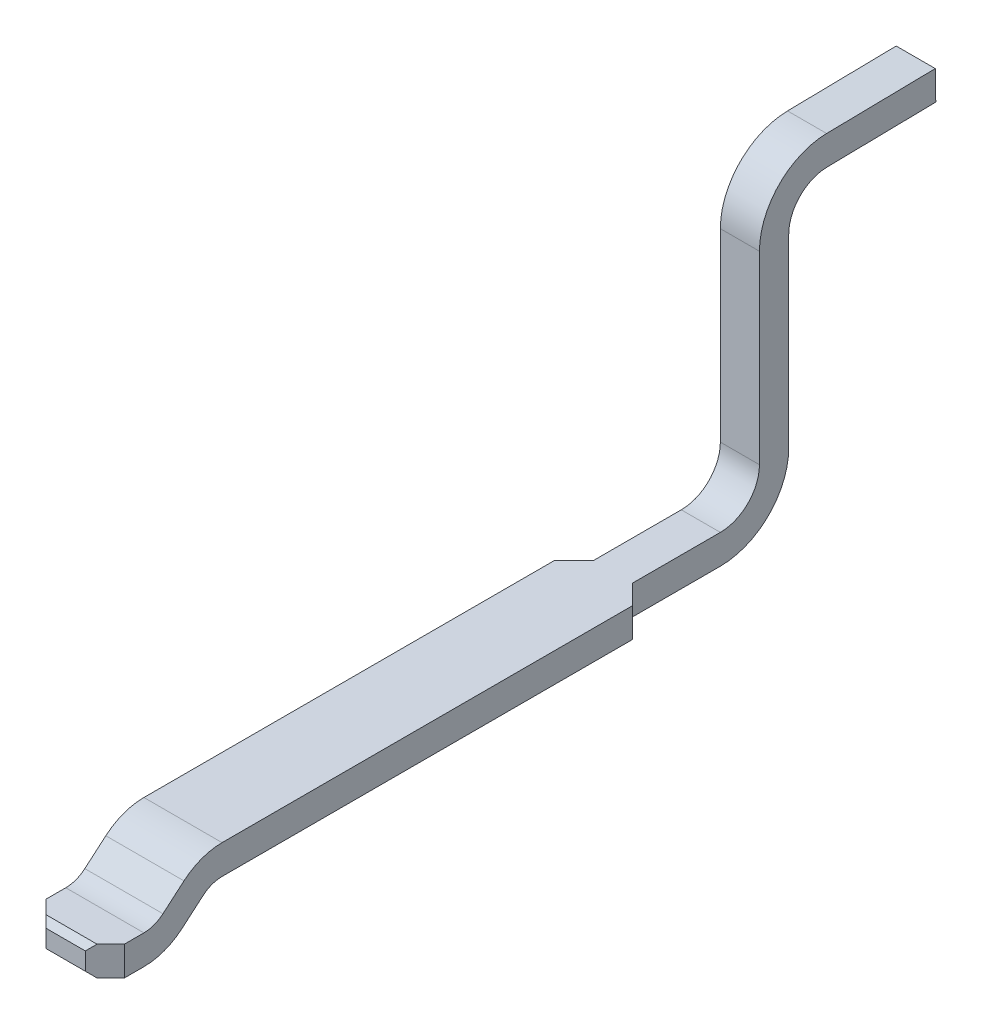
ISO-10303-21;
HEADER;
FILE_DESCRIPTION(('STEP AP214'),'2;1');
FILE_NAME('part.step','',(''),(''),'','','');
FILE_SCHEMA(('AUTOMOTIVE_DESIGN { 1 0 10303 214 1 1 1 1 }'));
ENDSEC;
DATA;
#1=APPLICATION_CONTEXT('core data for automotive mechanical design processes');
#2=APPLICATION_PROTOCOL_DEFINITION('international standard','automotive_design',2000,#1);
#3=PRODUCT_CONTEXT('',#1,'mechanical');
#4=PRODUCT('Part','Part','',(#3));
#5=PRODUCT_RELATED_PRODUCT_CATEGORY('part','',(#4));
#6=PRODUCT_DEFINITION_FORMATION('','',#4);
#7=PRODUCT_DEFINITION_CONTEXT('part definition',#1,'design');
#8=PRODUCT_DEFINITION('design','',#6,#7);
#9=PRODUCT_DEFINITION_SHAPE('','',#8);
#10=(LENGTH_UNIT() NAMED_UNIT(*) SI_UNIT(.MILLI.,.METRE.));
#11=(NAMED_UNIT(*) PLANE_ANGLE_UNIT() SI_UNIT($,.RADIAN.));
#12=(NAMED_UNIT(*) SI_UNIT($,.STERADIAN.) SOLID_ANGLE_UNIT());
#13=UNCERTAINTY_MEASURE_WITH_UNIT(LENGTH_MEASURE(1.E-05),#10,'distance_accuracy_value','');
#14=(GEOMETRIC_REPRESENTATION_CONTEXT(3) GLOBAL_UNCERTAINTY_ASSIGNED_CONTEXT((#13)) GLOBAL_UNIT_ASSIGNED_CONTEXT((#10,
#11,#12)) REPRESENTATION_CONTEXT('',''));
#15=CARTESIAN_POINT('',(0.,0.,0.));
#16=DIRECTION('',(0.,0.,1.));
#17=DIRECTION('',(1.,0.,0.));
#18=AXIS2_PLACEMENT_3D('',#15,#16,#17);
#19=CARTESIAN_POINT('',(3.80403496496787,8.074228109921,4.324047830079));
#20=DIRECTION('',(0.,0.707106781186548,0.707106781186548));
#21=DIRECTION('',(0.,-0.707106781186548,0.707106781186548));
#22=AXIS2_PLACEMENT_3D('',#19,#20,#21);
#23=PLANE('',#22);
#24=DIRECTION('',(-0.577350269189637,0.577350269189612,-0.577350269189629));
#25=VECTOR('',#24,1.);
#26=CARTESIAN_POINT('',(3.83973309999987,8.04019892,4.35807702));
#27=LINE('',#26,#25);
#28=CARTESIAN_POINT('',(3.83973309999987,8.04019892,4.35807702));
#29=VERTEX_POINT('',#28);
#30=CARTESIAN_POINT('',(3.80973309999987,8.07019892,4.32807702));
#31=VERTEX_POINT('',#30);
#32=EDGE_CURVE('E279',#29,#31,#27,.T.);
#33=ORIENTED_EDGE('',*,*,#32,.F.);
#34=DIRECTION('',(-1.,0.,0.));
#35=VECTOR('',#34,1.);
#36=CARTESIAN_POINT('',(4.04543123503187,8.04019892,4.35807702));
#37=LINE('',#36,#35);
#38=CARTESIAN_POINT('',(4.03973309999987,8.04019892,4.35807702));
#39=VERTEX_POINT('',#38);
#40=EDGE_CURVE('E356',#29,#39,#37,.F.);
#41=ORIENTED_EDGE('',*,*,#40,.T.);
#42=DIRECTION('',(-0.577350269189631,-0.577350269189615,0.577350269189631));
#43=VECTOR('',#42,1.);
#44=CARTESIAN_POINT('',(4.06973309999987,8.07019892,4.32807702));
#45=LINE('',#44,#43);
#46=CARTESIAN_POINT('',(4.06973309999987,8.07019892,4.32807702));
#47=VERTEX_POINT('',#46);
#48=EDGE_CURVE('E269',#47,#39,#45,.T.);
#49=ORIENTED_EDGE('',*,*,#48,.F.);
#50=DIRECTION('',(1.,0.,0.));
#51=VECTOR('',#50,1.);
#52=CARTESIAN_POINT('',(4.14773309999987,8.07019892,4.32807702));
#53=LINE('',#52,#51);
#54=EDGE_CURVE('E276',#31,#47,#53,.T.);
#55=ORIENTED_EDGE('',*,*,#54,.F.);
#56=EDGE_LOOP('',(#33,#41,#49,#55));
#57=FACE_BOUND('',#56,.T.);
#58=ADVANCED_FACE('F17',(#57),#23,.T.);
#59=CARTESIAN_POINT('',(4.04543123503187,7.944500784968,4.35807702));
#60=DIRECTION('',(0.,0.,-1.));
#61=DIRECTION('',(-1.,0.,0.));
#62=AXIS2_PLACEMENT_3D('',#59,#60,#61);
#63=PLANE('',#62);
#64=DIRECTION('',(0.,1.,0.));
#65=VECTOR('',#64,1.);
#66=CARTESIAN_POINT('',(4.03973309999987,7.914500784968,4.35807702));
#67=LINE('',#66,#65);
#68=CARTESIAN_POINT('',(4.03973309999987,7.95019892,4.35807702));
#69=VERTEX_POINT('',#68);
#70=EDGE_CURVE('E256',#39,#69,#67,.F.);
#71=ORIENTED_EDGE('',*,*,#70,.F.);
#72=ORIENTED_EDGE('',*,*,#40,.F.);
#73=DIRECTION('',(0.,1.,0.));
#74=VECTOR('',#73,1.);
#75=CARTESIAN_POINT('',(3.83973309999987,7.914500784968,4.35807702));
#76=LINE('',#75,#74);
#77=CARTESIAN_POINT('',(3.83973309999987,7.95019892,4.35807702));
#78=VERTEX_POINT('',#77);
#79=EDGE_CURVE('E338',#78,#29,#76,.T.);
#80=ORIENTED_EDGE('',*,*,#79,.F.);
#81=DIRECTION('',(1.,0.,0.));
#82=VECTOR('',#81,1.);
#83=CARTESIAN_POINT('',(4.07543123503187,7.95019892,4.35807702));
#84=LINE('',#83,#82);
#85=EDGE_CURVE('E331',#69,#78,#84,.F.);
#86=ORIENTED_EDGE('',*,*,#85,.F.);
#87=EDGE_LOOP('',(#71,#72,#80,#86));
#88=FACE_BOUND('',#87,.T.);
#89=ADVANCED_FACE('F775',(#88),#63,.F.);
#90=CARTESIAN_POINT('',(4.07543123503187,7.916169730079,4.324047830079));
#91=DIRECTION('',(0.,-0.707106781186548,0.707106781186548));
#92=DIRECTION('',(0.,-0.707106781186548,-0.707106781186548));
#93=AXIS2_PLACEMENT_3D('',#90,#91,#92);
#94=PLANE('',#93);
#95=DIRECTION('',(0.57735026918962,-0.577350269189637,-0.57735026918962));
#96=VECTOR('',#95,1.);
#97=CARTESIAN_POINT('',(4.03973309999987,7.95019892,4.35807702));
#98=LINE('',#97,#96);
#99=CARTESIAN_POINT('',(4.06973309999987,7.92019892,4.32807702));
#100=VERTEX_POINT('',#99);
#101=EDGE_CURVE('E270',#69,#100,#98,.T.);
#102=ORIENTED_EDGE('',*,*,#101,.F.);
#103=ORIENTED_EDGE('',*,*,#85,.T.);
#104=DIRECTION('',(0.577350269189626,0.577350269189634,0.577350269189617));
#105=VECTOR('',#104,1.);
#106=CARTESIAN_POINT('',(3.80973309999987,7.92019892,4.32807702));
#107=LINE('',#106,#105);
#108=CARTESIAN_POINT('',(3.80973309999987,7.92019892,4.32807702));
#109=VERTEX_POINT('',#108);
#110=EDGE_CURVE('E309',#109,#78,#107,.T.);
#111=ORIENTED_EDGE('',*,*,#110,.F.);
#112=DIRECTION('',(1.,0.,0.));
#113=VECTOR('',#112,1.);
#114=CARTESIAN_POINT('',(4.14773309999987,7.92019892,4.32807702));
#115=LINE('',#114,#113);
#116=EDGE_CURVE('E252',#109,#100,#115,.T.);
#117=ORIENTED_EDGE('',*,*,#116,.T.);
#118=EDGE_LOOP('',(#102,#103,#111,#117));
#119=FACE_BOUND('',#118,.T.);
#120=ADVANCED_FACE('F768',(#119),#94,.T.);
#121=CARTESIAN_POINT('',(4.04543123503187,8.45127780084181,0.758077020000001));
#122=DIRECTION('',(0.,0.,-1.));
#123=DIRECTION('',(-1.,0.,0.));
#124=AXIS2_PLACEMENT_3D('',#121,#122,#123);
#125=PLANE('',#124);
#126=DIRECTION('',(0.,1.,0.));
#127=VECTOR('',#126,1.);
#128=CARTESIAN_POINT('',(4.03973309999987,9.610333059471,0.758077020000001));
#129=LINE('',#128,#127);
#130=CARTESIAN_POINT('',(4.03973309999987,8.47019892,0.758077020000001));
#131=VERTEX_POINT('',#130);
#132=CARTESIAN_POINT('',(4.03973309999987,9.41625487791,0.758077020000001));
#133=VERTEX_POINT('',#132);
#134=EDGE_CURVE('E416',#131,#133,#129,.T.);
#135=ORIENTED_EDGE('',*,*,#134,.F.);
#136=DIRECTION('',(-1.,0.,0.));
#137=VECTOR('',#136,1.);
#138=CARTESIAN_POINT('',(4.03973309999987,8.47019892,0.75807702));
#139=LINE('',#138,#137);
#140=CARTESIAN_POINT('',(3.83973309999987,8.47019892,0.758077020000001));
#141=VERTEX_POINT('',#140);
#142=EDGE_CURVE('E213',#141,#131,#139,.F.);
#143=ORIENTED_EDGE('',*,*,#142,.F.);
#144=DIRECTION('',(0.,1.,0.));
#145=VECTOR('',#144,1.);
#146=CARTESIAN_POINT('',(3.83973309999987,8.45127780084181,0.758077020000001));
#147=LINE('',#146,#145);
#148=CARTESIAN_POINT('',(3.83973309999987,9.41625487791,0.758077020000001));
#149=VERTEX_POINT('',#148);
#150=EDGE_CURVE('E412',#149,#141,#147,.F.);
#151=ORIENTED_EDGE('',*,*,#150,.F.);
#152=DIRECTION('',(1.,0.,0.));
#153=VECTOR('',#152,1.);
#154=CARTESIAN_POINT('',(3.83973309999987,9.41625487791,0.758077020000001));
#155=LINE('',#154,#153);
#156=EDGE_CURVE('E306',#149,#133,#155,.T.);
#157=ORIENTED_EDGE('',*,*,#156,.T.);
#158=EDGE_LOOP('',(#135,#143,#151,#157));
#159=FACE_BOUND('',#158,.T.);
#160=ADVANCED_FACE('F579',(#159),#125,.T.);
#161=CARTESIAN_POINT('',(4.03973309999987,8.47019892,1.10807702));
#162=DIRECTION('',(-1.,0.,0.));
#163=DIRECTION('',(0.,0.,1.));
#164=AXIS2_PLACEMENT_3D('',#161,#162,#163);
#165=CYLINDRICAL_SURFACE('',#164,0.35);
#166=DIRECTION('',(1.,0.,0.));
#167=VECTOR('',#166,1.);
#168=CARTESIAN_POINT('',(4.14773309999987,8.12019892,1.10807702));
#169=LINE('',#168,#167);
#170=CARTESIAN_POINT('',(4.03973309999987,8.12019892,1.10807702));
#171=VERTEX_POINT('',#170);
#172=CARTESIAN_POINT('',(3.83973309999987,8.12019892,1.10807702));
#173=VERTEX_POINT('',#172);
#174=EDGE_CURVE('E229',#171,#173,#169,.F.);
#175=ORIENTED_EDGE('',*,*,#174,.T.);
#176=CARTESIAN_POINT('',(3.83973309999987,8.47019892,1.10807702));
#177=DIRECTION('',(-1.,0.,0.));
#178=DIRECTION('',(0.,0.,1.));
#179=AXIS2_PLACEMENT_3D('',#176,#177,#178);
#180=CIRCLE('',#179,0.35);
#181=EDGE_CURVE('E409',#141,#173,#180,.T.);
#182=ORIENTED_EDGE('',*,*,#181,.F.);
#183=ORIENTED_EDGE('',*,*,#142,.T.);
#184=CARTESIAN_POINT('',(4.03973309999987,8.47019892,1.10807702));
#185=DIRECTION('',(-1.,0.,0.));
#186=DIRECTION('',(0.,0.,1.));
#187=AXIS2_PLACEMENT_3D('',#184,#185,#186);
#188=CIRCLE('',#187,0.35);
#189=EDGE_CURVE('E417',#171,#131,#188,.F.);
#190=ORIENTED_EDGE('',*,*,#189,.F.);
#191=EDGE_LOOP('',(#175,#182,#183,#190));
#192=FACE_BOUND('',#191,.T.);
#193=ADVANCED_FACE('F576',(#192),#165,.T.);
#194=CARTESIAN_POINT('',(4.04543123503187,8.45127780084181,0.908077020000001));
#195=DIRECTION('',(0.,0.,-1.));
#196=DIRECTION('',(-1.,0.,0.));
#197=AXIS2_PLACEMENT_3D('',#194,#195,#196);
#198=PLANE('',#197);
#199=DIRECTION('',(-1.,0.,0.));
#200=VECTOR('',#199,1.);
#201=CARTESIAN_POINT('',(4.03973309999987,8.47019892,0.90807702));
#202=LINE('',#201,#200);
#203=CARTESIAN_POINT('',(3.83973309999987,8.47019892,0.908077020000001));
#204=VERTEX_POINT('',#203);
#205=CARTESIAN_POINT('',(4.03973309999987,8.47019892,0.908077020000001));
#206=VERTEX_POINT('',#205);
#207=EDGE_CURVE('E218',#204,#206,#202,.F.);
#208=ORIENTED_EDGE('',*,*,#207,.T.);
#209=DIRECTION('',(0.,1.,0.));
#210=VECTOR('',#209,1.);
#211=CARTESIAN_POINT('',(4.03973309999987,9.610333059471,0.908077020000001));
#212=LINE('',#211,#210);
#213=CARTESIAN_POINT('',(4.03973309999987,9.41625487791,0.908077020000001));
#214=VERTEX_POINT('',#213);
#215=EDGE_CURVE('E216',#214,#206,#212,.F.);
#216=ORIENTED_EDGE('',*,*,#215,.F.);
#217=DIRECTION('',(1.,0.,0.));
#218=VECTOR('',#217,1.);
#219=CARTESIAN_POINT('',(3.83973309999987,9.41625487791,0.908077020000001));
#220=LINE('',#219,#218);
#221=CARTESIAN_POINT('',(3.83973309999987,9.41625487791,0.908077020000001));
#222=VERTEX_POINT('',#221);
#223=EDGE_CURVE('E203',#222,#214,#220,.T.);
#224=ORIENTED_EDGE('',*,*,#223,.F.);
#225=DIRECTION('',(0.,1.,0.));
#226=VECTOR('',#225,1.);
#227=CARTESIAN_POINT('',(3.83973309999987,8.45127780084181,0.908077020000001));
#228=LINE('',#227,#226);
#229=EDGE_CURVE('E404',#204,#222,#228,.T.);
#230=ORIENTED_EDGE('',*,*,#229,.F.);
#231=EDGE_LOOP('',(#208,#216,#224,#230));
#232=FACE_BOUND('',#231,.T.);
#233=ADVANCED_FACE('F217',(#232),#198,.F.);
#234=CARTESIAN_POINT('',(3.83973309999987,9.41625487791,0.558077020000001));
#235=DIRECTION('',(1.,0.,0.));
#236=DIRECTION('',(0.,0.,-1.));
#237=AXIS2_PLACEMENT_3D('',#234,#235,#236);
#238=CYLINDRICAL_SURFACE('',#237,0.35);
#239=ORIENTED_EDGE('',*,*,#223,.T.);
#240=CARTESIAN_POINT('',(4.03973309999987,9.41625487791,0.558077020000001));
#241=DIRECTION('',(1.,0.,0.));
#242=DIRECTION('',(0.,0.,-1.));
#243=AXIS2_PLACEMENT_3D('',#240,#241,#242);
#244=CIRCLE('',#243,0.35);
#245=CARTESIAN_POINT('',(4.03973309999987,9.76620157121429,0.564185362253241));
#246=VERTEX_POINT('',#245);
#247=EDGE_CURVE('E20',#246,#214,#244,.T.);
#248=ORIENTED_EDGE('',*,*,#247,.F.);
#249=DIRECTION('',(1.,0.,0.));
#250=VECTOR('',#249,1.);
#251=CARTESIAN_POINT('',(3.83403496496787,9.76620157121458,0.564185362253011));
#252=LINE('',#251,#250);
#253=CARTESIAN_POINT('',(3.83973309999987,9.76620157121429,0.564185362253241));
#254=VERTEX_POINT('',#253);
#255=EDGE_CURVE('E198',#254,#246,#252,.T.);
#256=ORIENTED_EDGE('',*,*,#255,.F.);
#257=CARTESIAN_POINT('',(3.83973309999987,9.41625487791,0.558077020000001));
#258=DIRECTION('',(1.,0.,0.));
#259=DIRECTION('',(0.,0.,-1.));
#260=AXIS2_PLACEMENT_3D('',#257,#258,#259);
#261=CIRCLE('',#260,0.35);
#262=EDGE_CURVE('E209',#222,#254,#261,.F.);
#263=ORIENTED_EDGE('',*,*,#262,.F.);
#264=EDGE_LOOP('',(#239,#248,#256,#263));
#265=FACE_BOUND('',#264,.T.);
#266=ADVANCED_FACE('F205',(#265),#238,.T.);
#267=CARTESIAN_POINT('',(3.83403496496787,9.766007480923,0.575304787611001));
#268=DIRECTION('',(0.,0.999847695156406,0.0174524064364471));
#269=DIRECTION('',(0.,-0.0174524064364471,0.999847695156406));
#270=AXIS2_PLACEMENT_3D('',#267,#268,#269);
#271=PLANE('',#270);
#272=DIRECTION('',(0.,0.0174524064385203,-0.99984769515637));
#273=VECTOR('',#272,1.);
#274=CARTESIAN_POINT('',(3.83973309999987,9.766201571214,0.564185362253001));
#275=LINE('',#274,#273);
#276=CARTESIAN_POINT('',(3.83973309999987,9.775906085794,0.00821409435916126));
#277=VERTEX_POINT('',#276);
#278=EDGE_CURVE('E318',#254,#277,#275,.T.);
#279=ORIENTED_EDGE('',*,*,#278,.F.);
#280=ORIENTED_EDGE('',*,*,#255,.T.);
#281=DIRECTION('',(0.,-0.0174524064385203,0.99984769515637));
#282=VECTOR('',#281,1.);
#283=CARTESIAN_POINT('',(4.03973309999987,9.775906085794,0.00821409435900074));
#284=LINE('',#283,#282);
#285=CARTESIAN_POINT('',(4.03973309999987,9.775906085794,0.00821409435916126));
#286=VERTEX_POINT('',#285);
#287=EDGE_CURVE('E226',#286,#246,#284,.T.);
#288=ORIENTED_EDGE('',*,*,#287,.F.);
#289=DIRECTION('',(1.,0.,0.));
#290=VECTOR('',#289,1.);
#291=CARTESIAN_POINT('',(4.04543123503187,9.77590608579399,0.0082140943594823));
#292=LINE('',#291,#290);
#293=EDGE_CURVE('E311',#277,#286,#292,.T.);
#294=ORIENTED_EDGE('',*,*,#293,.F.);
#295=EDGE_LOOP('',(#279,#280,#288,#294));
#296=FACE_BOUND('',#295,.T.);
#297=ADVANCED_FACE('F593',(#296),#271,.T.);
#298=CARTESIAN_POINT('',(4.04543123503187,9.620231664342,0.00549678722500089));
#299=DIRECTION('',(0.,0.0174524064396861,-0.999847695156349));
#300=DIRECTION('',(0.,0.999847695156349,0.0174524064396861));
#301=AXIS2_PLACEMENT_3D('',#298,#299,#300);
#302=PLANE('',#301);
#303=DIRECTION('',(1.,0.,0.));
#304=VECTOR('',#303,1.);
#305=CARTESIAN_POINT('',(3.83403496496787,9.62592893152041,0.00559623339400797));
#306=LINE('',#305,#304);
#307=CARTESIAN_POINT('',(4.03973309999987,9.62592893152018,0.00559623339400417));
#308=VERTEX_POINT('',#307);
#309=CARTESIAN_POINT('',(3.83973309999987,9.62592893152014,0.00559623339400334));
#310=VERTEX_POINT('',#309);
#311=EDGE_CURVE('E307',#308,#310,#306,.F.);
#312=ORIENTED_EDGE('',*,*,#311,.T.);
#313=DIRECTION('',(0.,-0.999847695156461,-0.0174524064332696));
#314=VECTOR('',#313,1.);
#315=CARTESIAN_POINT('',(3.83973309999987,9.775906085794,0.00821409435900074));
#316=LINE('',#315,#314);
#317=EDGE_CURVE('E314',#277,#310,#316,.T.);
#318=ORIENTED_EDGE('',*,*,#317,.F.);
#319=ORIENTED_EDGE('',*,*,#293,.T.);
#320=DIRECTION('',(0.,0.999847695156461,0.0174524064332696));
#321=VECTOR('',#320,1.);
#322=CARTESIAN_POINT('',(4.03973309999987,9.62592893152,0.00559623339400103));
#323=LINE('',#322,#321);
#324=EDGE_CURVE('E328',#308,#286,#323,.T.);
#325=ORIENTED_EDGE('',*,*,#324,.F.);
#326=EDGE_LOOP('',(#312,#318,#319,#325));
#327=FACE_BOUND('',#326,.T.);
#328=ADVANCED_FACE('F592',(#327),#302,.T.);
#329=CARTESIAN_POINT('',(3.83403496496787,9.616030326649,0.572686926645001));
#330=DIRECTION('',(0.,0.999847695156375,0.0174524064382066));
#331=DIRECTION('',(0.,-0.0174524064382066,0.999847695156375));
#332=AXIS2_PLACEMENT_3D('',#329,#330,#331);
#333=PLANE('',#332);
#334=DIRECTION('',(1.,0.,0.));
#335=VECTOR('',#334,1.);
#336=CARTESIAN_POINT('',(3.83973309999987,9.61622441694128,0.561567501287006));
#337=LINE('',#336,#335);
#338=CARTESIAN_POINT('',(4.03973309999987,9.61622441694114,0.561567501287176));
#339=VERTEX_POINT('',#338);
#340=CARTESIAN_POINT('',(3.83973309999987,9.61622441694114,0.561567501287176));
#341=VERTEX_POINT('',#340);
#342=EDGE_CURVE('E304',#339,#341,#337,.F.);
#343=ORIENTED_EDGE('',*,*,#342,.T.);
#344=DIRECTION('',(0.,-0.0174524064367521,0.999847695156401));
#345=VECTOR('',#344,1.);
#346=CARTESIAN_POINT('',(3.83973309999987,9.62592893152,0.00559623339400103));
#347=LINE('',#346,#345);
#348=EDGE_CURVE('E317',#310,#341,#347,.T.);
#349=ORIENTED_EDGE('',*,*,#348,.F.);
#350=ORIENTED_EDGE('',*,*,#311,.F.);
#351=DIRECTION('',(0.,0.0174524064367521,-0.999847695156401));
#352=VECTOR('',#351,1.);
#353=CARTESIAN_POINT('',(4.03973309999987,9.616224416941,0.561567501287001));
#354=LINE('',#353,#352);
#355=EDGE_CURVE('E333',#339,#308,#354,.T.);
#356=ORIENTED_EDGE('',*,*,#355,.F.);
#357=EDGE_LOOP('',(#343,#349,#350,#356));
#358=FACE_BOUND('',#357,.T.);
#359=ADVANCED_FACE('F588',(#358),#333,.F.);
#360=CARTESIAN_POINT('',(3.83973309999987,9.41625487791,0.558077020000001));
#361=DIRECTION('',(1.,0.,0.));
#362=DIRECTION('',(0.,0.,-1.));
#363=AXIS2_PLACEMENT_3D('',#360,#361,#362);
#364=CYLINDRICAL_SURFACE('',#363,0.2);
#365=ORIENTED_EDGE('',*,*,#156,.F.);
#366=CARTESIAN_POINT('',(3.83973309999987,9.41625487791,0.558077020000001));
#367=DIRECTION('',(1.,0.,0.));
#368=DIRECTION('',(0.,0.,-1.));
#369=AXIS2_PLACEMENT_3D('',#366,#367,#368);
#370=CIRCLE('',#369,0.2);
#371=EDGE_CURVE('E400',#341,#149,#370,.T.);
#372=ORIENTED_EDGE('',*,*,#371,.F.);
#373=ORIENTED_EDGE('',*,*,#342,.F.);
#374=CARTESIAN_POINT('',(4.03973309999987,9.41625487791,0.558077020000001));
#375=DIRECTION('',(1.,0.,0.));
#376=DIRECTION('',(0.,0.,-1.));
#377=AXIS2_PLACEMENT_3D('',#374,#375,#376);
#378=CIRCLE('',#377,0.2);
#379=EDGE_CURVE('E414',#133,#339,#378,.F.);
#380=ORIENTED_EDGE('',*,*,#379,.F.);
#381=EDGE_LOOP('',(#365,#372,#373,#380));
#382=FACE_BOUND('',#381,.T.);
#383=ADVANCED_FACE('F584',(#382),#364,.F.);
#384=CARTESIAN_POINT('',(3.73570391007887,7.914500784968,4.254047830079));
#385=DIRECTION('',(-0.707106781186548,0.,0.707106781186548));
#386=DIRECTION('',(0.707106781186548,0.,0.707106781186548));
#387=AXIS2_PLACEMENT_3D('',#384,#385,#386);
#388=PLANE('',#387);
#389=DIRECTION('',(0.,1.,0.));
#390=VECTOR('',#389,1.);
#391=CARTESIAN_POINT('',(3.73973309999987,7.914500784968,4.25807702));
#392=LINE('',#391,#390);
#393=CARTESIAN_POINT('',(3.73973309999987,8.07019892,4.25807702));
#394=VERTEX_POINT('',#393);
#395=CARTESIAN_POINT('',(3.73973309999987,7.92019892,4.25807702));
#396=VERTEX_POINT('',#395);
#397=EDGE_CURVE('E295',#394,#396,#392,.F.);
#398=ORIENTED_EDGE('',*,*,#397,.T.);
#399=DIRECTION('',(0.707106781186548,0.,0.707106781186548));
#400=VECTOR('',#399,1.);
#401=CARTESIAN_POINT('',(3.73973309999987,7.92019892,4.25807702));
#402=LINE('',#401,#400);
#403=EDGE_CURVE('E255',#396,#109,#402,.T.);
#404=ORIENTED_EDGE('',*,*,#403,.T.);
#405=ORIENTED_EDGE('',*,*,#110,.T.);
#406=ORIENTED_EDGE('',*,*,#79,.T.);
#407=ORIENTED_EDGE('',*,*,#32,.T.);
#408=DIRECTION('',(0.707106781186548,0.,0.707106781186548));
#409=VECTOR('',#408,1.);
#410=CARTESIAN_POINT('',(3.73973309999987,8.07019892,4.25807702));
#411=LINE('',#410,#409);
#412=EDGE_CURVE('E275',#394,#31,#411,.T.);
#413=ORIENTED_EDGE('',*,*,#412,.F.);
#414=EDGE_LOOP('',(#398,#404,#405,#406,#407,#413));
#415=FACE_BOUND('',#414,.T.);
#416=ADVANCED_FACE('F712',(#415),#388,.T.);
#417=CARTESIAN_POINT('',(4.14773309999987,8.102515836027,4.064893542443));
#418=DIRECTION('',(0.,0.759858617954068,0.650088363779058));
#419=DIRECTION('',(0.,-0.650088363779058,0.759858617954068));
#420=AXIS2_PLACEMENT_3D('',#417,#418,#419);
#421=PLANE('',#420);
#422=DIRECTION('',(0.,-0.650088363774947,0.759858617957586));
#423=VECTOR('',#422,1.);
#424=CARTESIAN_POINT('',(3.73973309999987,8.198156505386,3.953103529133));
#425=LINE('',#424,#423);
#426=CARTESIAN_POINT('',(3.73973309999987,8.19815650538664,3.95310352913274));
#427=VERTEX_POINT('',#426);
#428=CARTESIAN_POINT('',(3.73973309999987,8.10622012730668,4.06056376543338));
#429=VERTEX_POINT('',#428);
#430=EDGE_CURVE('E393',#427,#429,#425,.T.);
#431=ORIENTED_EDGE('',*,*,#430,.T.);
#432=DIRECTION('',(-1.,0.,0.));
#433=VECTOR('',#432,1.);
#434=CARTESIAN_POINT('',(4.13973309999987,8.10622012730701,4.06056376543301));
#435=LINE('',#434,#433);
#436=CARTESIAN_POINT('',(4.13973309999987,8.10622012730668,4.06056376543338));
#437=VERTEX_POINT('',#436);
#438=EDGE_CURVE('E277',#429,#437,#435,.F.);
#439=ORIENTED_EDGE('',*,*,#438,.T.);
#440=DIRECTION('',(0.,-0.650088363774947,0.759858617957586));
#441=VECTOR('',#440,1.);
#442=CARTESIAN_POINT('',(4.13973309999987,8.198156505386,3.953103529133));
#443=LINE('',#442,#441);
#444=CARTESIAN_POINT('',(4.13973309999987,8.19815650538664,3.95310352913274));
#445=VERTEX_POINT('',#444);
#446=EDGE_CURVE('E385',#445,#437,#443,.T.);
#447=ORIENTED_EDGE('',*,*,#446,.F.);
#448=DIRECTION('',(-1.,0.,0.));
#449=VECTOR('',#448,1.);
#450=CARTESIAN_POINT('',(4.13973309999987,8.19815650538648,3.95310352913341));
#451=LINE('',#450,#449);
#452=EDGE_CURVE('E280',#427,#445,#451,.F.);
#453=ORIENTED_EDGE('',*,*,#452,.F.);
#454=EDGE_LOOP('',(#431,#439,#447,#453));
#455=FACE_BOUND('',#454,.T.);
#456=ADVANCED_FACE('F528',(#455),#421,.T.);
#457=CARTESIAN_POINT('',(4.13973309999987,8.22019892,4.15807702));
#458=DIRECTION('',(-1.,0.,0.));
#459=DIRECTION('',(0.,0.,1.));
#460=AXIS2_PLACEMENT_3D('',#457,#458,#459);
#461=CYLINDRICAL_SURFACE('',#460,0.15);
#462=CARTESIAN_POINT('',(3.73973309999987,8.22019892,4.15807702));
#463=DIRECTION('',(-1.,0.,0.));
#464=DIRECTION('',(0.,0.,1.));
#465=AXIS2_PLACEMENT_3D('',#462,#463,#464);
#466=CIRCLE('',#465,0.15);
#467=CARTESIAN_POINT('',(3.73973309999987,8.07019892,4.15807702));
#468=VERTEX_POINT('',#467);
#469=EDGE_CURVE('E390',#429,#468,#466,.T.);
#470=ORIENTED_EDGE('',*,*,#469,.T.);
#471=DIRECTION('',(1.,0.,0.));
#472=VECTOR('',#471,1.);
#473=CARTESIAN_POINT('',(4.14773309999987,8.07019892,4.15807702));
#474=LINE('',#473,#472);
#475=CARTESIAN_POINT('',(4.13973309999987,8.07019892,4.15807702));
#476=VERTEX_POINT('',#475);
#477=EDGE_CURVE('E273',#476,#468,#474,.F.);
#478=ORIENTED_EDGE('',*,*,#477,.F.);
#479=CARTESIAN_POINT('',(4.13973309999987,8.22019892,4.15807702));
#480=DIRECTION('',(-1.,0.,0.));
#481=DIRECTION('',(0.,0.,1.));
#482=AXIS2_PLACEMENT_3D('',#479,#480,#481);
#483=CIRCLE('',#482,0.15);
#484=EDGE_CURVE('E382',#437,#476,#483,.T.);
#485=ORIENTED_EDGE('',*,*,#484,.F.);
#486=ORIENTED_EDGE('',*,*,#438,.F.);
#487=EDGE_LOOP('',(#470,#478,#485,#486));
#488=FACE_BOUND('',#487,.T.);
#489=ADVANCED_FACE('F533',(#488),#461,.F.);
#490=CARTESIAN_POINT('',(4.14773309999987,8.07019892,4.333775155032));
#491=DIRECTION('',(0.,1.,0.));
#492=DIRECTION('',(0.,0.,1.));
#493=AXIS2_PLACEMENT_3D('',#490,#491,#492);
#494=PLANE('',#493);
#495=DIRECTION('',(0.,0.,-1.));
#496=VECTOR('',#495,1.);
#497=CARTESIAN_POINT('',(3.73973309999987,8.07019892,4.163775155032));
#498=LINE('',#497,#496);
#499=EDGE_CURVE('E287',#468,#394,#498,.F.);
#500=ORIENTED_EDGE('',*,*,#499,.T.);
#501=ORIENTED_EDGE('',*,*,#412,.T.);
#502=ORIENTED_EDGE('',*,*,#54,.T.);
#503=DIRECTION('',(0.707106781186548,0.,-0.707106781186548));
#504=VECTOR('',#503,1.);
#505=CARTESIAN_POINT('',(4.03570391007887,8.07019892,4.362106209921));
#506=LINE('',#505,#504);
#507=CARTESIAN_POINT('',(4.13973309999987,8.07019892,4.25807702));
#508=VERTEX_POINT('',#507);
#509=EDGE_CURVE('E266',#508,#47,#506,.F.);
#510=ORIENTED_EDGE('',*,*,#509,.F.);
#511=DIRECTION('',(0.,0.,-1.));
#512=VECTOR('',#511,1.);
#513=CARTESIAN_POINT('',(4.13973309999987,8.07019892,3.80007702));
#514=LINE('',#513,#512);
#515=EDGE_CURVE('E263',#476,#508,#514,.F.);
#516=ORIENTED_EDGE('',*,*,#515,.F.);
#517=ORIENTED_EDGE('',*,*,#477,.T.);
#518=EDGE_LOOP('',(#500,#501,#502,#510,#516,#517));
#519=FACE_BOUND('',#518,.T.);
#520=ADVANCED_FACE('F537',(#519),#494,.T.);
#521=CARTESIAN_POINT('',(4.03570391007887,7.914500784968,4.362106209921));
#522=DIRECTION('',(0.707106781186548,0.,0.707106781186548));
#523=DIRECTION('',(0.707106781186548,0.,-0.707106781186548));
#524=AXIS2_PLACEMENT_3D('',#521,#522,#523);
#525=PLANE('',#524);
#526=ORIENTED_EDGE('',*,*,#48,.T.);
#527=ORIENTED_EDGE('',*,*,#70,.T.);
#528=ORIENTED_EDGE('',*,*,#101,.T.);
#529=DIRECTION('',(0.707106781186543,0.,-0.707106781186552));
#530=VECTOR('',#529,1.);
#531=CARTESIAN_POINT('',(4.06973309999987,7.92019892,4.32807702));
#532=LINE('',#531,#530);
#533=CARTESIAN_POINT('',(4.13973309999987,7.92019892,4.25807702));
#534=VERTEX_POINT('',#533);
#535=EDGE_CURVE('E253',#100,#534,#532,.T.);
#536=ORIENTED_EDGE('',*,*,#535,.T.);
#537=DIRECTION('',(0.,1.,0.));
#538=VECTOR('',#537,1.);
#539=CARTESIAN_POINT('',(4.13973309999987,8.114500784968,4.25807702));
#540=LINE('',#539,#538);
#541=EDGE_CURVE('E259',#508,#534,#540,.F.);
#542=ORIENTED_EDGE('',*,*,#541,.F.);
#543=ORIENTED_EDGE('',*,*,#509,.T.);
#544=EDGE_LOOP('',(#526,#527,#528,#536,#542,#543));
#545=FACE_BOUND('',#544,.T.);
#546=ADVANCED_FACE('F540',(#545),#525,.T.);
#547=CARTESIAN_POINT('',(4.14773309999987,7.92019892,4.333775155032));
#548=DIRECTION('',(0.,1.,0.));
#549=DIRECTION('',(0.,0.,1.));
#550=AXIS2_PLACEMENT_3D('',#547,#548,#549);
#551=PLANE('',#550);
#552=ORIENTED_EDGE('',*,*,#403,.F.);
#553=DIRECTION('',(0.,0.,-1.));
#554=VECTOR('',#553,1.);
#555=CARTESIAN_POINT('',(3.73973309999987,7.92019892,4.163775155032));
#556=LINE('',#555,#554);
#557=CARTESIAN_POINT('',(3.73973309999987,7.92019892,4.15807702));
#558=VERTEX_POINT('',#557);
#559=EDGE_CURVE('E297',#396,#558,#556,.T.);
#560=ORIENTED_EDGE('',*,*,#559,.T.);
#561=DIRECTION('',(-1.,0.,0.));
#562=VECTOR('',#561,1.);
#563=CARTESIAN_POINT('',(4.13973309999987,7.92019892,4.15807702));
#564=LINE('',#563,#562);
#565=CARTESIAN_POINT('',(4.13973309999987,7.92019892,4.15807702));
#566=VERTEX_POINT('',#565);
#567=EDGE_CURVE('E249',#566,#558,#564,.T.);
#568=ORIENTED_EDGE('',*,*,#567,.F.);
#569=DIRECTION('',(0.,0.,-1.));
#570=VECTOR('',#569,1.);
#571=CARTESIAN_POINT('',(4.13973309999987,7.92019892,3.80007702));
#572=LINE('',#571,#570);
#573=EDGE_CURVE('E262',#534,#566,#572,.T.);
#574=ORIENTED_EDGE('',*,*,#573,.F.);
#575=ORIENTED_EDGE('',*,*,#535,.F.);
#576=ORIENTED_EDGE('',*,*,#116,.F.);
#577=EDGE_LOOP('',(#552,#560,#568,#574,#575,#576));
#578=FACE_BOUND('',#577,.T.);
#579=ADVANCED_FACE('F547',(#578),#551,.F.);
#580=CARTESIAN_POINT('',(4.13973309999987,8.22019892,4.15807702));
#581=DIRECTION('',(-1.,0.,0.));
#582=DIRECTION('',(0.,0.,1.));
#583=AXIS2_PLACEMENT_3D('',#580,#581,#582);
#584=CYLINDRICAL_SURFACE('',#583,0.3);
#585=CARTESIAN_POINT('',(3.73973309999987,8.22019892,4.15807702));
#586=DIRECTION('',(-1.,0.,0.));
#587=DIRECTION('',(0.,0.,1.));
#588=AXIS2_PLACEMENT_3D('',#585,#586,#587);
#589=CIRCLE('',#588,0.3);
#590=CARTESIAN_POINT('',(3.73973309999987,7.99224133461339,3.96305051086728));
#591=VERTEX_POINT('',#590);
#592=EDGE_CURVE('E398',#558,#591,#589,.F.);
#593=ORIENTED_EDGE('',*,*,#592,.T.);
#594=DIRECTION('',(1.,0.,0.));
#595=VECTOR('',#594,1.);
#596=CARTESIAN_POINT('',(4.14773309999987,7.99224133461357,3.96305051086664));
#597=LINE('',#596,#595);
#598=CARTESIAN_POINT('',(4.13973309999987,7.99224133461339,3.96305051086728));
#599=VERTEX_POINT('',#598);
#600=EDGE_CURVE('E247',#591,#599,#597,.T.);
#601=ORIENTED_EDGE('',*,*,#600,.T.);
#602=CARTESIAN_POINT('',(4.13973309999987,8.22019892,4.15807702));
#603=DIRECTION('',(-1.,0.,0.));
#604=DIRECTION('',(0.,0.,1.));
#605=AXIS2_PLACEMENT_3D('',#602,#603,#604);
#606=CIRCLE('',#605,0.3);
#607=EDGE_CURVE('E379',#566,#599,#606,.F.);
#608=ORIENTED_EDGE('',*,*,#607,.F.);
#609=ORIENTED_EDGE('',*,*,#567,.T.);
#610=EDGE_LOOP('',(#593,#601,#608,#609));
#611=FACE_BOUND('',#610,.T.);
#612=ADVANCED_FACE('F551',(#611),#584,.T.);
#613=CARTESIAN_POINT('',(4.14773309999987,7.988537043334,3.967380287877));
#614=DIRECTION('',(0.,0.759858617954068,0.650088363779058));
#615=DIRECTION('',(0.,-0.650088363779058,0.759858617954068));
#616=AXIS2_PLACEMENT_3D('',#613,#614,#615);
#617=PLANE('',#616);
#618=ORIENTED_EDGE('',*,*,#600,.F.);
#619=DIRECTION('',(0.,0.650088363774937,-0.759858617957595));
#620=VECTOR('',#619,1.);
#621=CARTESIAN_POINT('',(3.73973309999987,7.992241334614,3.963050510867));
#622=LINE('',#621,#620);
#623=CARTESIAN_POINT('',(3.73973309999987,8.08417771269332,3.85559027456662));
#624=VERTEX_POINT('',#623);
#625=EDGE_CURVE('E397',#591,#624,#622,.T.);
#626=ORIENTED_EDGE('',*,*,#625,.T.);
#627=DIRECTION('',(-1.,0.,0.));
#628=VECTOR('',#627,1.);
#629=CARTESIAN_POINT('',(4.13973309999987,8.08417771269299,3.85559027456699));
#630=LINE('',#629,#628);
#631=CARTESIAN_POINT('',(4.13973309999987,8.08417771269332,3.85559027456662));
#632=VERTEX_POINT('',#631);
#633=EDGE_CURVE('E243',#624,#632,#630,.F.);
#634=ORIENTED_EDGE('',*,*,#633,.T.);
#635=DIRECTION('',(0.,0.650088363774937,-0.759858617957595));
#636=VECTOR('',#635,1.);
#637=CARTESIAN_POINT('',(4.13973309999987,7.992241334614,3.963050510867));
#638=LINE('',#637,#636);
#639=EDGE_CURVE('E378',#599,#632,#638,.T.);
#640=ORIENTED_EDGE('',*,*,#639,.F.);
#641=EDGE_LOOP('',(#618,#626,#634,#640));
#642=FACE_BOUND('',#641,.T.);
#643=ADVANCED_FACE('F556',(#642),#617,.F.);
#644=CARTESIAN_POINT('',(4.13973309999987,7.97019892,3.75807702));
#645=DIRECTION('',(-1.,0.,0.));
#646=DIRECTION('',(0.,0.,1.));
#647=AXIS2_PLACEMENT_3D('',#644,#645,#646);
#648=CYLINDRICAL_SURFACE('',#647,0.15);
#649=CARTESIAN_POINT('',(3.73973309999987,7.97019892,3.75807702));
#650=DIRECTION('',(-1.,0.,0.));
#651=DIRECTION('',(0.,0.,1.));
#652=AXIS2_PLACEMENT_3D('',#649,#650,#651);
#653=CIRCLE('',#652,0.15);
#654=CARTESIAN_POINT('',(3.73973309999987,8.12019892,3.75807702));
#655=VERTEX_POINT('',#654);
#656=EDGE_CURVE('E394',#624,#655,#653,.T.);
#657=ORIENTED_EDGE('',*,*,#656,.T.);
#658=DIRECTION('',(1.,0.,0.));
#659=VECTOR('',#658,1.);
#660=CARTESIAN_POINT('',(4.14773309999987,8.12019892,3.75807702));
#661=LINE('',#660,#659);
#662=CARTESIAN_POINT('',(4.13973309999987,8.12019892,3.75807702));
#663=VERTEX_POINT('',#662);
#664=EDGE_CURVE('E227',#655,#663,#661,.T.);
#665=ORIENTED_EDGE('',*,*,#664,.T.);
#666=CARTESIAN_POINT('',(4.13973309999987,7.97019892,3.75807702));
#667=DIRECTION('',(-1.,0.,0.));
#668=DIRECTION('',(0.,0.,1.));
#669=AXIS2_PLACEMENT_3D('',#666,#667,#668);
#670=CIRCLE('',#669,0.15);
#671=EDGE_CURVE('E374',#632,#663,#670,.T.);
#672=ORIENTED_EDGE('',*,*,#671,.F.);
#673=ORIENTED_EDGE('',*,*,#633,.F.);
#674=EDGE_LOOP('',(#657,#665,#672,#673));
#675=FACE_BOUND('',#674,.T.);
#676=ADVANCED_FACE('F560',(#675),#648,.F.);
#677=CARTESIAN_POINT('',(4.14773309999987,8.12019892,3.81107702));
#678=DIRECTION('',(0.,1.,0.));
#679=DIRECTION('',(0.,0.,1.));
#680=AXIS2_PLACEMENT_3D('',#677,#678,#679);
#681=PLANE('',#680);
#682=ORIENTED_EDGE('',*,*,#664,.F.);
#683=DIRECTION('',(0.,0.,-1.));
#684=VECTOR('',#683,1.);
#685=CARTESIAN_POINT('',(3.73973309999987,8.12019892,4.163775155032));
#686=LINE('',#685,#684);
#687=CARTESIAN_POINT('',(3.73973309999987,8.12019892,1.65807702));
#688=VERTEX_POINT('',#687);
#689=EDGE_CURVE('E396',#655,#688,#686,.T.);
#690=ORIENTED_EDGE('',*,*,#689,.T.);
#691=DIRECTION('',(-0.707106781186548,0.,0.707106781186548));
#692=VECTOR('',#691,1.);
#693=CARTESIAN_POINT('',(3.73570391007887,8.12019892,1.662106209921));
#694=LINE('',#693,#692);
#695=CARTESIAN_POINT('',(3.83973309999987,8.12019892,1.55807702));
#696=VERTEX_POINT('',#695);
#697=EDGE_CURVE('E284',#696,#688,#694,.T.);
#698=ORIENTED_EDGE('',*,*,#697,.F.);
#699=DIRECTION('',(0.,0.,1.));
#700=VECTOR('',#699,1.);
#701=CARTESIAN_POINT('',(3.83973309999987,8.12019892,0.913775155032));
#702=LINE('',#701,#700);
#703=EDGE_CURVE('E408',#173,#696,#702,.T.);
#704=ORIENTED_EDGE('',*,*,#703,.F.);
#705=ORIENTED_EDGE('',*,*,#174,.F.);
#706=DIRECTION('',(0.,0.,-1.));
#707=VECTOR('',#706,1.);
#708=CARTESIAN_POINT('',(4.03973309999987,8.12019892,0.572587480477));
#709=LINE('',#708,#707);
#710=CARTESIAN_POINT('',(4.03973309999987,8.12019892,1.55807702));
#711=VERTEX_POINT('',#710);
#712=EDGE_CURVE('E221',#711,#171,#709,.T.);
#713=ORIENTED_EDGE('',*,*,#712,.F.);
#714=DIRECTION('',(-0.707106781186549,0.,-0.707106781186546));
#715=VECTOR('',#714,1.);
#716=CARTESIAN_POINT('',(4.13973309999987,8.12019892,1.65807702));
#717=LINE('',#716,#715);
#718=CARTESIAN_POINT('',(4.13973309999987,8.12019892,1.65807702));
#719=VERTEX_POINT('',#718);
#720=EDGE_CURVE('E241',#719,#711,#717,.T.);
#721=ORIENTED_EDGE('',*,*,#720,.F.);
#722=DIRECTION('',(0.,0.,-1.));
#723=VECTOR('',#722,1.);
#724=CARTESIAN_POINT('',(4.13973309999987,8.12019892,3.80007702));
#725=LINE('',#724,#723);
#726=EDGE_CURVE('E377',#663,#719,#725,.T.);
#727=ORIENTED_EDGE('',*,*,#726,.F.);
#728=EDGE_LOOP('',(#682,#690,#698,#704,#705,#713,#721,#727));
#729=FACE_BOUND('',#728,.T.);
#730=ADVANCED_FACE('F562',(#729),#681,.F.);
#731=CARTESIAN_POINT('',(4.03973309999987,9.610333059471,0.572587480477));
#732=DIRECTION('',(1.,0.,0.));
#733=DIRECTION('',(0.,0.,-1.));
#734=AXIS2_PLACEMENT_3D('',#731,#732,#733);
#735=PLANE('',#734);
#736=ORIENTED_EDGE('',*,*,#355,.T.);
#737=ORIENTED_EDGE('',*,*,#324,.T.);
#738=ORIENTED_EDGE('',*,*,#287,.T.);
#739=ORIENTED_EDGE('',*,*,#247,.T.);
#740=ORIENTED_EDGE('',*,*,#215,.T.);
#741=CARTESIAN_POINT('',(4.03973309999987,8.47019892,1.10807702));
#742=DIRECTION('',(-1.,0.,0.));
#743=DIRECTION('',(0.,0.,1.));
#744=AXIS2_PLACEMENT_3D('',#741,#742,#743);
#745=CIRCLE('',#744,0.2);
#746=CARTESIAN_POINT('',(4.03973309999987,8.27019892,1.10807702));
#747=VERTEX_POINT('',#746);
#748=EDGE_CURVE('E327',#206,#747,#745,.T.);
#749=ORIENTED_EDGE('',*,*,#748,.T.);
#750=DIRECTION('',(0.,0.,1.));
#751=VECTOR('',#750,1.);
#752=CARTESIAN_POINT('',(4.03973309999987,8.27019892,3.81107702));
#753=LINE('',#752,#751);
#754=CARTESIAN_POINT('',(4.03973309999987,8.27019892,1.55807702));
#755=VERTEX_POINT('',#754);
#756=EDGE_CURVE('E238',#755,#747,#753,.F.);
#757=ORIENTED_EDGE('',*,*,#756,.F.);
#758=DIRECTION('',(0.,1.,0.));
#759=VECTOR('',#758,1.);
#760=CARTESIAN_POINT('',(4.03973309999987,8.275897055032,1.55807702));
#761=LINE('',#760,#759);
#762=EDGE_CURVE('E235',#711,#755,#761,.T.);
#763=ORIENTED_EDGE('',*,*,#762,.F.);
#764=ORIENTED_EDGE('',*,*,#712,.T.);
#765=ORIENTED_EDGE('',*,*,#189,.T.);
#766=ORIENTED_EDGE('',*,*,#134,.T.);
#767=ORIENTED_EDGE('',*,*,#379,.T.);
#768=EDGE_LOOP('',(#736,#737,#738,#739,#740,#749,#757,#763,#764,#765,#766,#767));
#769=FACE_BOUND('',#768,.T.);
#770=ADVANCED_FACE('F224',(#769),#735,.T.);
#771=CARTESIAN_POINT('',(4.03973309999987,8.47019892,1.10807702));
#772=DIRECTION('',(-1.,0.,0.));
#773=DIRECTION('',(0.,0.,1.));
#774=AXIS2_PLACEMENT_3D('',#771,#772,#773);
#775=CYLINDRICAL_SURFACE('',#774,0.2);
#776=DIRECTION('',(1.,0.,0.));
#777=VECTOR('',#776,1.);
#778=CARTESIAN_POINT('',(4.14773309999987,8.27019892,1.10807702));
#779=LINE('',#778,#777);
#780=CARTESIAN_POINT('',(3.83973309999987,8.27019892,1.10807702));
#781=VERTEX_POINT('',#780);
#782=EDGE_CURVE('E435',#747,#781,#779,.F.);
#783=ORIENTED_EDGE('',*,*,#782,.F.);
#784=ORIENTED_EDGE('',*,*,#748,.F.);
#785=ORIENTED_EDGE('',*,*,#207,.F.);
#786=CARTESIAN_POINT('',(3.83973309999987,8.47019892,1.10807702));
#787=DIRECTION('',(-1.,0.,0.));
#788=DIRECTION('',(0.,0.,1.));
#789=AXIS2_PLACEMENT_3D('',#786,#787,#788);
#790=CIRCLE('',#789,0.2);
#791=EDGE_CURVE('E405',#781,#204,#790,.F.);
#792=ORIENTED_EDGE('',*,*,#791,.F.);
#793=EDGE_LOOP('',(#783,#784,#785,#792));
#794=FACE_BOUND('',#793,.T.);
#795=ADVANCED_FACE('F597',(#794),#775,.F.);
#796=CARTESIAN_POINT('',(3.83973309999987,8.45127780084181,0.913775155032));
#797=DIRECTION('',(-1.,0.,0.));
#798=DIRECTION('',(0.,0.,1.));
#799=AXIS2_PLACEMENT_3D('',#796,#797,#798);
#800=PLANE('',#799);
#801=ORIENTED_EDGE('',*,*,#348,.T.);
#802=ORIENTED_EDGE('',*,*,#371,.T.);
#803=ORIENTED_EDGE('',*,*,#150,.T.);
#804=ORIENTED_EDGE('',*,*,#181,.T.);
#805=ORIENTED_EDGE('',*,*,#703,.T.);
#806=DIRECTION('',(0.,1.,0.));
#807=VECTOR('',#806,1.);
#808=CARTESIAN_POINT('',(3.83973309999987,8.275897055032,1.55807702));
#809=LINE('',#808,#807);
#810=CARTESIAN_POINT('',(3.83973309999987,8.27019892,1.55807702));
#811=VERTEX_POINT('',#810);
#812=EDGE_CURVE('E288',#811,#696,#809,.F.);
#813=ORIENTED_EDGE('',*,*,#812,.F.);
#814=DIRECTION('',(0.,0.,1.));
#815=VECTOR('',#814,1.);
#816=CARTESIAN_POINT('',(3.83973309999987,8.27019892,3.81107702));
#817=LINE('',#816,#815);
#818=EDGE_CURVE('E438',#781,#811,#817,.T.);
#819=ORIENTED_EDGE('',*,*,#818,.F.);
#820=ORIENTED_EDGE('',*,*,#791,.T.);
#821=ORIENTED_EDGE('',*,*,#229,.T.);
#822=ORIENTED_EDGE('',*,*,#262,.T.);
#823=ORIENTED_EDGE('',*,*,#278,.T.);
#824=ORIENTED_EDGE('',*,*,#317,.T.);
#825=EDGE_LOOP('',(#801,#802,#803,#804,#805,#813,#819,#820,#821,#822,#823,#824));
#826=FACE_BOUND('',#825,.T.);
#827=ADVANCED_FACE('F574',(#826),#800,.T.);
#828=CARTESIAN_POINT('',(3.73570391007887,8.275897055032,1.662106209921));
#829=DIRECTION('',(-0.707106781186548,0.,-0.707106781186548));
#830=DIRECTION('',(-0.707106781186548,0.,0.707106781186548));
#831=AXIS2_PLACEMENT_3D('',#828,#829,#830);
#832=PLANE('',#831);
#833=DIRECTION('',(0.,1.,0.));
#834=VECTOR('',#833,1.);
#835=CARTESIAN_POINT('',(3.73973309999987,7.914500784968,1.65807702));
#836=LINE('',#835,#834);
#837=CARTESIAN_POINT('',(3.73973309999987,8.27019892,1.65807702));
#838=VERTEX_POINT('',#837);
#839=EDGE_CURVE('E469',#688,#838,#836,.T.);
#840=ORIENTED_EDGE('',*,*,#839,.T.);
#841=DIRECTION('',(-0.707106781186549,0.,0.707106781186546));
#842=VECTOR('',#841,1.);
#843=CARTESIAN_POINT('',(3.83973309999987,8.27019892,1.55807702));
#844=LINE('',#843,#842);
#845=EDGE_CURVE('E457',#811,#838,#844,.T.);
#846=ORIENTED_EDGE('',*,*,#845,.F.);
#847=ORIENTED_EDGE('',*,*,#812,.T.);
#848=ORIENTED_EDGE('',*,*,#697,.T.);
#849=EDGE_LOOP('',(#840,#846,#847,#848));
#850=FACE_BOUND('',#849,.T.);
#851=ADVANCED_FACE('F570',(#850),#832,.T.);
#852=CARTESIAN_POINT('',(3.73973309999987,7.914500784968,4.163775155032));
#853=DIRECTION('',(1.,0.,0.));
#854=DIRECTION('',(0.,0.,-1.));
#855=AXIS2_PLACEMENT_3D('',#852,#853,#854);
#856=PLANE('',#855);
#857=ORIENTED_EDGE('',*,*,#430,.F.);
#858=CARTESIAN_POINT('',(3.73973309999987,7.97019892,3.75807702));
#859=DIRECTION('',(-1.,0.,0.));
#860=DIRECTION('',(0.,0.,1.));
#861=AXIS2_PLACEMENT_3D('',#858,#859,#860);
#862=CIRCLE('',#861,0.3);
#863=CARTESIAN_POINT('',(3.73973309999987,8.27019892,3.75807702));
#864=VERTEX_POINT('',#863);
#865=EDGE_CURVE('E283',#864,#427,#862,.F.);
#866=ORIENTED_EDGE('',*,*,#865,.F.);
#867=DIRECTION('',(0.,0.,1.));
#868=VECTOR('',#867,1.);
#869=CARTESIAN_POINT('',(3.73973309999987,8.27019892,3.81107702));
#870=LINE('',#869,#868);
#871=EDGE_CURVE('E466',#838,#864,#870,.T.);
#872=ORIENTED_EDGE('',*,*,#871,.F.);
#873=ORIENTED_EDGE('',*,*,#839,.F.);
#874=ORIENTED_EDGE('',*,*,#689,.F.);
#875=ORIENTED_EDGE('',*,*,#656,.F.);
#876=ORIENTED_EDGE('',*,*,#625,.F.);
#877=ORIENTED_EDGE('',*,*,#592,.F.);
#878=ORIENTED_EDGE('',*,*,#559,.F.);
#879=ORIENTED_EDGE('',*,*,#397,.F.);
#880=ORIENTED_EDGE('',*,*,#499,.F.);
#881=ORIENTED_EDGE('',*,*,#469,.F.);
#882=EDGE_LOOP('',(#857,#866,#872,#873,#874,#875,#876,#877,#878,#879,#880,#881));
#883=FACE_BOUND('',#882,.T.);
#884=ADVANCED_FACE('F566',(#883),#856,.F.);
#885=CARTESIAN_POINT('',(4.13973309999987,7.97019892,3.75807702));
#886=DIRECTION('',(-1.,0.,0.));
#887=DIRECTION('',(0.,0.,1.));
#888=AXIS2_PLACEMENT_3D('',#885,#886,#887);
#889=CYLINDRICAL_SURFACE('',#888,0.3);
#890=ORIENTED_EDGE('',*,*,#865,.T.);
#891=ORIENTED_EDGE('',*,*,#452,.T.);
#892=CARTESIAN_POINT('',(4.13973309999987,7.97019892,3.75807702));
#893=DIRECTION('',(-1.,0.,0.));
#894=DIRECTION('',(0.,0.,1.));
#895=AXIS2_PLACEMENT_3D('',#892,#893,#894);
#896=CIRCLE('',#895,0.3);
#897=CARTESIAN_POINT('',(4.13973309999987,8.27019892,3.75807702));
#898=VERTEX_POINT('',#897);
#899=EDGE_CURVE('E282',#898,#445,#896,.F.);
#900=ORIENTED_EDGE('',*,*,#899,.F.);
#901=DIRECTION('',(1.,0.,0.));
#902=VECTOR('',#901,1.);
#903=CARTESIAN_POINT('',(4.14773309999987,8.27019892,3.75807702));
#904=LINE('',#903,#902);
#905=EDGE_CURVE('E487',#864,#898,#904,.T.);
#906=ORIENTED_EDGE('',*,*,#905,.F.);
#907=EDGE_LOOP('',(#890,#891,#900,#906));
#908=FACE_BOUND('',#907,.T.);
#909=ADVANCED_FACE('F525',(#908),#889,.T.);
#910=CARTESIAN_POINT('',(4.13973309999987,8.114500784968,3.80007702));
#911=DIRECTION('',(1.,0.,0.));
#912=DIRECTION('',(0.,0.,-1.));
#913=AXIS2_PLACEMENT_3D('',#910,#911,#912);
#914=PLANE('',#913);
#915=ORIENTED_EDGE('',*,*,#671,.T.);
#916=ORIENTED_EDGE('',*,*,#726,.T.);
#917=DIRECTION('',(0.,1.,0.));
#918=VECTOR('',#917,1.);
#919=CARTESIAN_POINT('',(4.13973309999987,8.275897055032,1.65807702));
#920=LINE('',#919,#918);
#921=CARTESIAN_POINT('',(4.13973309999987,8.27019892,1.65807702));
#922=VERTEX_POINT('',#921);
#923=EDGE_CURVE('E35',#922,#719,#920,.F.);
#924=ORIENTED_EDGE('',*,*,#923,.F.);
#925=DIRECTION('',(0.,0.,1.));
#926=VECTOR('',#925,1.);
#927=CARTESIAN_POINT('',(4.13973309999987,8.27019892,3.81107702));
#928=LINE('',#927,#926);
#929=EDGE_CURVE('E26',#898,#922,#928,.F.);
#930=ORIENTED_EDGE('',*,*,#929,.F.);
#931=ORIENTED_EDGE('',*,*,#899,.T.);
#932=ORIENTED_EDGE('',*,*,#446,.T.);
#933=ORIENTED_EDGE('',*,*,#484,.T.);
#934=ORIENTED_EDGE('',*,*,#515,.T.);
#935=ORIENTED_EDGE('',*,*,#541,.T.);
#936=ORIENTED_EDGE('',*,*,#573,.T.);
#937=ORIENTED_EDGE('',*,*,#607,.T.);
#938=ORIENTED_EDGE('',*,*,#639,.T.);
#939=EDGE_LOOP('',(#915,#916,#924,#930,#931,#932,#933,#934,#935,#936,#937,#938));
#940=FACE_BOUND('',#939,.T.);
#941=ADVANCED_FACE('F514',(#940),#914,.T.);
#942=CARTESIAN_POINT('',(4.03570391007887,8.275897055032,1.554047830079));
#943=DIRECTION('',(0.707106781186548,0.,-0.707106781186548));
#944=DIRECTION('',(-0.707106781186548,0.,-0.707106781186548));
#945=AXIS2_PLACEMENT_3D('',#942,#943,#944);
#946=PLANE('',#945);
#947=ORIENTED_EDGE('',*,*,#762,.T.);
#948=DIRECTION('',(-0.707106781186549,0.,-0.707106781186546));
#949=VECTOR('',#948,1.);
#950=CARTESIAN_POINT('',(4.13973309999987,8.27019892,1.65807702));
#951=LINE('',#950,#949);
#952=EDGE_CURVE('E11',#922,#755,#951,.T.);
#953=ORIENTED_EDGE('',*,*,#952,.F.);
#954=ORIENTED_EDGE('',*,*,#923,.T.);
#955=ORIENTED_EDGE('',*,*,#720,.T.);
#956=EDGE_LOOP('',(#947,#953,#954,#955));
#957=FACE_BOUND('',#956,.T.);
#958=ADVANCED_FACE('F519',(#957),#946,.T.);
#959=CARTESIAN_POINT('',(4.14773309999987,8.27019892,3.81107702));
#960=DIRECTION('',(0.,1.,0.));
#961=DIRECTION('',(0.,0.,1.));
#962=AXIS2_PLACEMENT_3D('',#959,#960,#961);
#963=PLANE('',#962);
#964=ORIENTED_EDGE('',*,*,#929,.T.);
#965=ORIENTED_EDGE('',*,*,#952,.T.);
#966=ORIENTED_EDGE('',*,*,#756,.T.);
#967=ORIENTED_EDGE('',*,*,#782,.T.);
#968=ORIENTED_EDGE('',*,*,#818,.T.);
#969=ORIENTED_EDGE('',*,*,#845,.T.);
#970=ORIENTED_EDGE('',*,*,#871,.T.);
#971=ORIENTED_EDGE('',*,*,#905,.T.);
#972=EDGE_LOOP('',(#964,#965,#966,#967,#968,#969,#970,#971));
#973=FACE_BOUND('',#972,.T.);
#974=ADVANCED_FACE('F521',(#973),#963,.T.);
#975=CLOSED_SHELL('',(#58,#89,#120,#160,#193,#233,#266,#297,#328,#359,#383,#416,#456,#489,#520,
#546,#579,#612,#643,#676,#730,#770,#795,#827,#851,#884,#909,#941,#958,#974));
#976=MANIFOLD_SOLID_BREP('B1',#975);
#977=ADVANCED_BREP_SHAPE_REPRESENTATION('',(#18,#976),#14);
#978=SHAPE_DEFINITION_REPRESENTATION(#9,#977);
ENDSEC;
END-ISO-10303-21;
